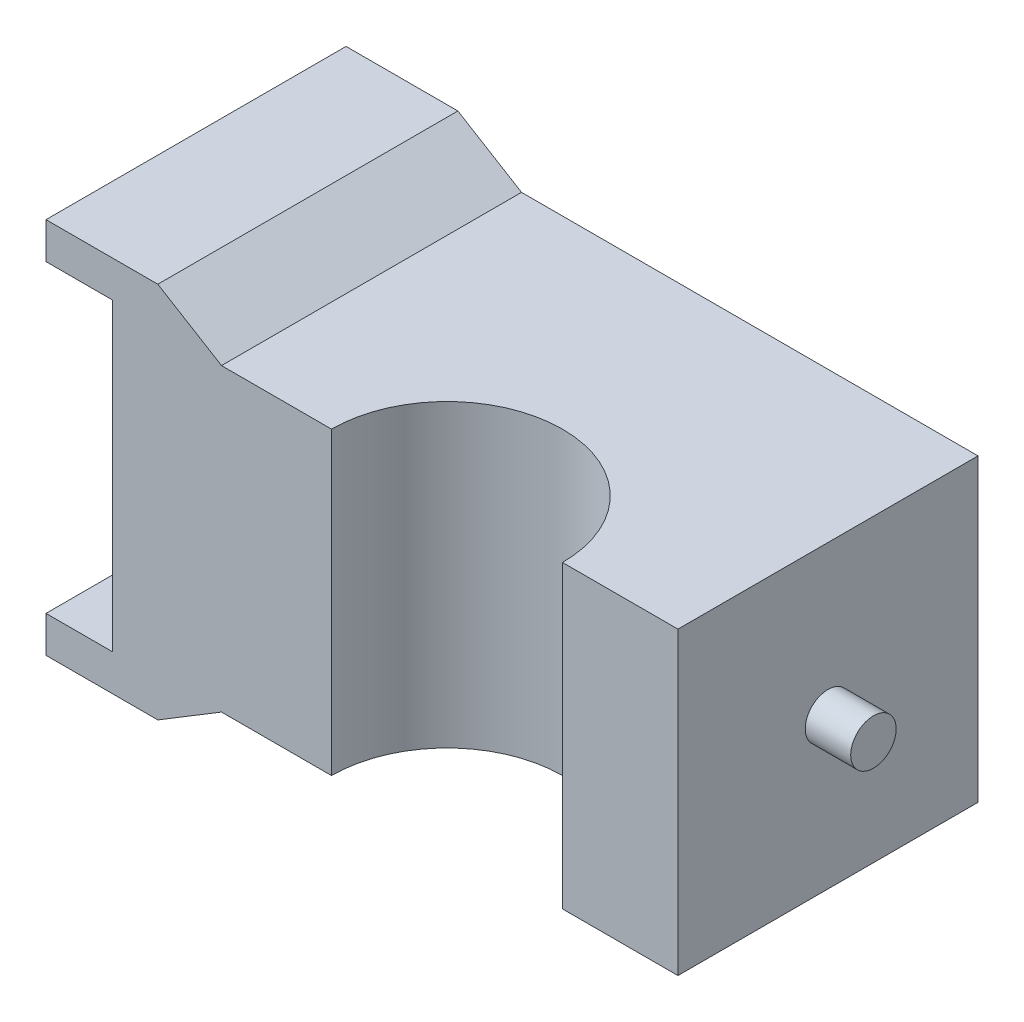
ISO-10303-21;
HEADER;
FILE_DESCRIPTION(('STEP AP214'),'2;1');
FILE_NAME('part.step','',(''),(''),'','','');
FILE_SCHEMA(('AUTOMOTIVE_DESIGN { 1 0 10303 214 1 1 1 1 }'));
ENDSEC;
DATA;
#1=APPLICATION_CONTEXT('core data for automotive mechanical design processes');
#2=APPLICATION_PROTOCOL_DEFINITION('international standard','automotive_design',2000,#1);
#3=PRODUCT_CONTEXT('',#1,'mechanical');
#4=PRODUCT('Part','Part','',(#3));
#5=PRODUCT_RELATED_PRODUCT_CATEGORY('part','',(#4));
#6=PRODUCT_DEFINITION_FORMATION('','',#4);
#7=PRODUCT_DEFINITION_CONTEXT('part definition',#1,'design');
#8=PRODUCT_DEFINITION('design','',#6,#7);
#9=PRODUCT_DEFINITION_SHAPE('','',#8);
#10=(LENGTH_UNIT() NAMED_UNIT(*) SI_UNIT(.MILLI.,.METRE.));
#11=(NAMED_UNIT(*) PLANE_ANGLE_UNIT() SI_UNIT($,.RADIAN.));
#12=(NAMED_UNIT(*) SI_UNIT($,.STERADIAN.) SOLID_ANGLE_UNIT());
#13=UNCERTAINTY_MEASURE_WITH_UNIT(LENGTH_MEASURE(1.E-05),#10,'distance_accuracy_value','');
#14=(GEOMETRIC_REPRESENTATION_CONTEXT(3) GLOBAL_UNCERTAINTY_ASSIGNED_CONTEXT((#13)) GLOBAL_UNIT_ASSIGNED_CONTEXT((#10,
#11,#12)) REPRESENTATION_CONTEXT('',''));
#15=CARTESIAN_POINT('',(0.,0.,0.));
#16=DIRECTION('',(0.,0.,1.));
#17=DIRECTION('',(1.,0.,0.));
#18=AXIS2_PLACEMENT_3D('',#15,#16,#17);
#19=CARTESIAN_POINT('',(0.,0.,16.5));
#20=DIRECTION('',(0.,0.,-1.));
#21=DIRECTION('',(-1.,0.,0.));
#22=AXIS2_PLACEMENT_3D('',#19,#20,#21);
#23=PLANE('',#22);
#24=DIRECTION('',(0.,-1.,0.));
#25=VECTOR('',#24,1.);
#26=CARTESIAN_POINT('',(12.4,20.75,16.5));
#27=LINE('',#26,#25);
#28=CARTESIAN_POINT('',(12.4,-16.5,16.5));
#29=VERTEX_POINT('',#28);
#30=CARTESIAN_POINT('',(12.4,16.5,16.5));
#31=VERTEX_POINT('',#30);
#32=EDGE_CURVE('E11',#29,#31,#27,.F.);
#33=ORIENTED_EDGE('',*,*,#32,.F.);
#34=DIRECTION('',(1.,0.,0.));
#35=VECTOR('',#34,1.);
#36=CARTESIAN_POINT('',(25.1,-16.5,16.5));
#37=LINE('',#36,#35);
#38=CARTESIAN_POINT('',(25.1,-16.5,16.5));
#39=VERTEX_POINT('',#38);
#40=EDGE_CURVE('E63',#29,#39,#37,.T.);
#41=ORIENTED_EDGE('',*,*,#40,.T.);
#42=DIRECTION('',(0.,1.,0.));
#43=VECTOR('',#42,1.);
#44=CARTESIAN_POINT('',(25.1,16.5,16.5));
#45=LINE('',#44,#43);
#46=CARTESIAN_POINT('',(25.1,16.5,16.5));
#47=VERTEX_POINT('',#46);
#48=EDGE_CURVE('E201',#39,#47,#45,.T.);
#49=ORIENTED_EDGE('',*,*,#48,.T.);
#50=DIRECTION('',(-1.,0.,0.));
#51=VECTOR('',#50,1.);
#52=CARTESIAN_POINT('',(25.1,16.5,16.5));
#53=LINE('',#52,#51);
#54=EDGE_CURVE('E117',#47,#31,#53,.T.);
#55=ORIENTED_EDGE('',*,*,#54,.T.);
#56=EDGE_LOOP('',(#33,#41,#49,#55));
#57=FACE_BOUND('',#56,.T.);
#58=ADVANCED_FACE('F40',(#57),#23,.F.);
#59=DIRECTION('',(0.,-1.,0.));
#60=VECTOR('',#59,1.);
#61=CARTESIAN_POINT('',(-13.,20.75,16.5));
#62=LINE('',#61,#60);
#63=CARTESIAN_POINT('',(-13.,16.5000000000001,16.5));
#64=VERTEX_POINT('',#63);
#65=CARTESIAN_POINT('',(-13.,-16.5,16.5));
#66=VERTEX_POINT('',#65);
#67=EDGE_CURVE('E48',#64,#66,#62,.T.);
#68=ORIENTED_EDGE('',*,*,#67,.F.);
#69=CARTESIAN_POINT('',(-25.1,16.5,16.5));
#70=VERTEX_POINT('',#69);
#71=EDGE_CURVE('E251',#64,#70,#53,.T.);
#72=ORIENTED_EDGE('',*,*,#71,.T.);
#73=DIRECTION('',(-0.854787515221729,0.518978134241763,0.));
#74=VECTOR('',#73,1.);
#75=CARTESIAN_POINT('',(-32.1,20.75,16.5));
#76=LINE('',#75,#74);
#77=CARTESIAN_POINT('',(-32.1,20.75,16.5));
#78=VERTEX_POINT('',#77);
#79=EDGE_CURVE('E253',#70,#78,#76,.T.);
#80=ORIENTED_EDGE('',*,*,#79,.T.);
#81=DIRECTION('',(-1.,0.,0.));
#82=VECTOR('',#81,1.);
#83=CARTESIAN_POINT('',(-44.4,20.75,16.5));
#84=LINE('',#83,#82);
#85=CARTESIAN_POINT('',(-44.4,20.75,16.5));
#86=VERTEX_POINT('',#85);
#87=EDGE_CURVE('E255',#78,#86,#84,.T.);
#88=ORIENTED_EDGE('',*,*,#87,.T.);
#89=DIRECTION('',(0.,-1.,0.));
#90=VECTOR('',#89,1.);
#91=CARTESIAN_POINT('',(-44.4,20.75,16.5));
#92=LINE('',#91,#90);
#93=CARTESIAN_POINT('',(-44.4,16.75,16.5));
#94=VERTEX_POINT('',#93);
#95=EDGE_CURVE('E257',#86,#94,#92,.T.);
#96=ORIENTED_EDGE('',*,*,#95,.T.);
#97=DIRECTION('',(1.,0.,0.));
#98=VECTOR('',#97,1.);
#99=CARTESIAN_POINT('',(-44.4,16.75,16.5));
#100=LINE('',#99,#98);
#101=CARTESIAN_POINT('',(-37.1,16.75,16.5));
#102=VERTEX_POINT('',#101);
#103=EDGE_CURVE('E259',#94,#102,#100,.T.);
#104=ORIENTED_EDGE('',*,*,#103,.T.);
#105=DIRECTION('',(0.,-1.,0.));
#106=VECTOR('',#105,1.);
#107=CARTESIAN_POINT('',(-37.1,16.75,16.5));
#108=LINE('',#107,#106);
#109=CARTESIAN_POINT('',(-37.1,-16.75,16.5));
#110=VERTEX_POINT('',#109);
#111=EDGE_CURVE('E261',#102,#110,#108,.T.);
#112=ORIENTED_EDGE('',*,*,#111,.T.);
#113=DIRECTION('',(-1.,0.,0.));
#114=VECTOR('',#113,1.);
#115=CARTESIAN_POINT('',(-44.4,-16.75,16.5));
#116=LINE('',#115,#114);
#117=CARTESIAN_POINT('',(-44.4,-16.75,16.5));
#118=VERTEX_POINT('',#117);
#119=EDGE_CURVE('E263',#110,#118,#116,.T.);
#120=ORIENTED_EDGE('',*,*,#119,.T.);
#121=DIRECTION('',(0.,-1.,0.));
#122=VECTOR('',#121,1.);
#123=CARTESIAN_POINT('',(-44.4,-20.75,16.5));
#124=LINE('',#123,#122);
#125=CARTESIAN_POINT('',(-44.4,-20.75,16.5));
#126=VERTEX_POINT('',#125);
#127=EDGE_CURVE('E154',#118,#126,#124,.T.);
#128=ORIENTED_EDGE('',*,*,#127,.T.);
#129=DIRECTION('',(1.,0.,0.));
#130=VECTOR('',#129,1.);
#131=CARTESIAN_POINT('',(-44.4,-20.75,16.5));
#132=LINE('',#131,#130);
#133=CARTESIAN_POINT('',(-32.1,-20.75,16.5));
#134=VERTEX_POINT('',#133);
#135=EDGE_CURVE('E146',#126,#134,#132,.T.);
#136=ORIENTED_EDGE('',*,*,#135,.T.);
#137=DIRECTION('',(0.85478751522173,0.518978134241763,0.));
#138=VECTOR('',#137,1.);
#139=CARTESIAN_POINT('',(-32.1,-20.75,16.5));
#140=LINE('',#139,#138);
#141=CARTESIAN_POINT('',(-25.1,-16.5,16.5));
#142=VERTEX_POINT('',#141);
#143=EDGE_CURVE('E151',#134,#142,#140,.T.);
#144=ORIENTED_EDGE('',*,*,#143,.T.);
#145=EDGE_CURVE('E172',#142,#66,#37,.T.);
#146=ORIENTED_EDGE('',*,*,#145,.T.);
#147=EDGE_LOOP('',(#68,#72,#80,#88,#96,#104,#112,#120,#128,#136,#144,#146));
#148=FACE_BOUND('',#147,.T.);
#149=ADVANCED_FACE('F148',(#148),#23,.F.);
#150=CARTESIAN_POINT('',(25.1,16.5,16.5));
#151=DIRECTION('',(-1.,0.,0.));
#152=DIRECTION('',(0.,-1.,0.));
#153=AXIS2_PLACEMENT_3D('',#150,#151,#152);
#154=PLANE('',#153);
#155=DIRECTION('',(0.,1.,0.));
#156=VECTOR('',#155,1.);
#157=CARTESIAN_POINT('',(25.1,16.5,-16.5));
#158=LINE('',#157,#156);
#159=CARTESIAN_POINT('',(25.1,-16.5,-16.5));
#160=VERTEX_POINT('',#159);
#161=CARTESIAN_POINT('',(25.1,16.5,-16.5));
#162=VERTEX_POINT('',#161);
#163=EDGE_CURVE('E177',#160,#162,#158,.T.);
#164=ORIENTED_EDGE('',*,*,#163,.T.);
#165=DIRECTION('',(0.,0.,-1.));
#166=VECTOR('',#165,1.);
#167=CARTESIAN_POINT('',(25.1,16.5,16.5));
#168=LINE('',#167,#166);
#169=EDGE_CURVE('E226',#47,#162,#168,.T.);
#170=ORIENTED_EDGE('',*,*,#169,.F.);
#171=ORIENTED_EDGE('',*,*,#48,.F.);
#172=DIRECTION('',(0.,0.,-1.));
#173=VECTOR('',#172,1.);
#174=CARTESIAN_POINT('',(25.1,-16.5,16.5));
#175=LINE('',#174,#173);
#176=EDGE_CURVE('E176',#39,#160,#175,.T.);
#177=ORIENTED_EDGE('',*,*,#176,.T.);
#178=EDGE_LOOP('',(#164,#170,#171,#177));
#179=FACE_BOUND('',#178,.T.);
#180=CARTESIAN_POINT('',(25.1,0.,0.));
#181=DIRECTION('',(-1.,0.,0.));
#182=DIRECTION('',(0.,-1.,0.));
#183=AXIS2_PLACEMENT_3D('',#180,#181,#182);
#184=CIRCLE('',#183,2.5);
#185=CARTESIAN_POINT('',(25.1,-2.50000000000001,0.));
#186=VERTEX_POINT('',#185);
#187=EDGE_CURVE('E231',#186,#186,#184,.F.);
#188=ORIENTED_EDGE('',*,*,#187,.F.);
#189=EDGE_LOOP('',(#188));
#190=FACE_BOUND('',#189,.T.);
#191=ADVANCED_FACE('F42',(#179,#190),#154,.F.);
#192=CARTESIAN_POINT('',(-37.1,16.75,16.5));
#193=DIRECTION('',(1.,0.,0.));
#194=DIRECTION('',(0.,1.,0.));
#195=AXIS2_PLACEMENT_3D('',#192,#193,#194);
#196=PLANE('',#195);
#197=DIRECTION('',(0.,-1.,0.));
#198=VECTOR('',#197,1.);
#199=CARTESIAN_POINT('',(-37.1,16.75,-16.5));
#200=LINE('',#199,#198);
#201=CARTESIAN_POINT('',(-37.1,16.75,-16.5));
#202=VERTEX_POINT('',#201);
#203=CARTESIAN_POINT('',(-37.1,-16.75,-16.5));
#204=VERTEX_POINT('',#203);
#205=EDGE_CURVE('E191',#202,#204,#200,.T.);
#206=ORIENTED_EDGE('',*,*,#205,.T.);
#207=DIRECTION('',(0.,0.,-1.));
#208=VECTOR('',#207,1.);
#209=CARTESIAN_POINT('',(-37.1,-16.75,16.5));
#210=LINE('',#209,#208);
#211=EDGE_CURVE('E208',#110,#204,#210,.T.);
#212=ORIENTED_EDGE('',*,*,#211,.F.);
#213=ORIENTED_EDGE('',*,*,#111,.F.);
#214=DIRECTION('',(0.,0.,-1.));
#215=VECTOR('',#214,1.);
#216=CARTESIAN_POINT('',(-37.1,16.75,16.5));
#217=LINE('',#216,#215);
#218=EDGE_CURVE('E211',#102,#202,#217,.T.);
#219=ORIENTED_EDGE('',*,*,#218,.T.);
#220=EDGE_LOOP('',(#206,#212,#213,#219));
#221=FACE_BOUND('',#220,.T.);
#222=CARTESIAN_POINT('',(-37.1,0.,0.));
#223=DIRECTION('',(1.,0.,0.));
#224=DIRECTION('',(0.,1.,0.));
#225=AXIS2_PLACEMENT_3D('',#222,#223,#224);
#226=CIRCLE('',#225,2.5);
#227=CARTESIAN_POINT('',(-37.1,2.49999999999999,0.));
#228=VERTEX_POINT('',#227);
#229=EDGE_CURVE('E228',#228,#228,#226,.F.);
#230=ORIENTED_EDGE('',*,*,#229,.F.);
#231=EDGE_LOOP('',(#230));
#232=FACE_BOUND('',#231,.T.);
#233=ADVANCED_FACE('F305',(#221,#232),#196,.F.);
#234=CARTESIAN_POINT('',(25.1,16.5,16.5));
#235=DIRECTION('',(0.,-1.,0.));
#236=DIRECTION('',(1.,0.,0.));
#237=AXIS2_PLACEMENT_3D('',#234,#235,#236);
#238=PLANE('',#237);
#239=CARTESIAN_POINT('',(-0.299999999999998,16.5,16.5));
#240=DIRECTION('',(0.,-1.,0.));
#241=DIRECTION('',(1.,0.,0.));
#242=AXIS2_PLACEMENT_3D('',#239,#240,#241);
#243=CIRCLE('',#242,12.7);
#244=EDGE_CURVE('E54',#31,#64,#243,.F.);
#245=ORIENTED_EDGE('',*,*,#244,.F.);
#246=ORIENTED_EDGE('',*,*,#54,.F.);
#247=ORIENTED_EDGE('',*,*,#169,.T.);
#248=DIRECTION('',(-1.,0.,0.));
#249=VECTOR('',#248,1.);
#250=CARTESIAN_POINT('',(25.1,16.5,-16.5));
#251=LINE('',#250,#249);
#252=CARTESIAN_POINT('',(-25.1,16.5,-16.5));
#253=VERTEX_POINT('',#252);
#254=EDGE_CURVE('E180',#162,#253,#251,.T.);
#255=ORIENTED_EDGE('',*,*,#254,.T.);
#256=DIRECTION('',(0.,0.,-1.));
#257=VECTOR('',#256,1.);
#258=CARTESIAN_POINT('',(-25.1,16.5,16.5));
#259=LINE('',#258,#257);
#260=EDGE_CURVE('E223',#70,#253,#259,.T.);
#261=ORIENTED_EDGE('',*,*,#260,.F.);
#262=ORIENTED_EDGE('',*,*,#71,.F.);
#263=EDGE_LOOP('',(#245,#246,#247,#255,#261,#262));
#264=FACE_BOUND('',#263,.T.);
#265=ADVANCED_FACE('F282',(#264),#238,.F.);
#266=CARTESIAN_POINT('',(-32.1,20.75,16.5));
#267=DIRECTION('',(-0.518978134241763,-0.854787515221729,0.));
#268=DIRECTION('',(0.85478751522173,-0.518978134241763,0.));
#269=AXIS2_PLACEMENT_3D('',#266,#267,#268);
#270=PLANE('',#269);
#271=DIRECTION('',(-0.854787515221729,0.518978134241763,0.));
#272=VECTOR('',#271,1.);
#273=CARTESIAN_POINT('',(-32.1,20.75,-16.5));
#274=LINE('',#273,#272);
#275=CARTESIAN_POINT('',(-32.1,20.75,-16.5));
#276=VERTEX_POINT('',#275);
#277=EDGE_CURVE('E183',#253,#276,#274,.T.);
#278=ORIENTED_EDGE('',*,*,#277,.T.);
#279=DIRECTION('',(0.,0.,-1.));
#280=VECTOR('',#279,1.);
#281=CARTESIAN_POINT('',(-32.1,20.75,16.5));
#282=LINE('',#281,#280);
#283=EDGE_CURVE('E220',#78,#276,#282,.T.);
#284=ORIENTED_EDGE('',*,*,#283,.F.);
#285=ORIENTED_EDGE('',*,*,#79,.F.);
#286=ORIENTED_EDGE('',*,*,#260,.T.);
#287=EDGE_LOOP('',(#278,#284,#285,#286));
#288=FACE_BOUND('',#287,.T.);
#289=ADVANCED_FACE('F289',(#288),#270,.F.);
#290=CARTESIAN_POINT('',(-44.4,20.75,16.5));
#291=DIRECTION('',(0.,-1.,0.));
#292=DIRECTION('',(1.,0.,0.));
#293=AXIS2_PLACEMENT_3D('',#290,#291,#292);
#294=PLANE('',#293);
#295=DIRECTION('',(-1.,0.,0.));
#296=VECTOR('',#295,1.);
#297=CARTESIAN_POINT('',(-44.4,20.75,-16.5));
#298=LINE('',#297,#296);
#299=CARTESIAN_POINT('',(-44.4,20.75,-16.5));
#300=VERTEX_POINT('',#299);
#301=EDGE_CURVE('E185',#276,#300,#298,.T.);
#302=ORIENTED_EDGE('',*,*,#301,.T.);
#303=DIRECTION('',(0.,0.,-1.));
#304=VECTOR('',#303,1.);
#305=CARTESIAN_POINT('',(-44.4,20.75,16.5));
#306=LINE('',#305,#304);
#307=EDGE_CURVE('E217',#86,#300,#306,.T.);
#308=ORIENTED_EDGE('',*,*,#307,.F.);
#309=ORIENTED_EDGE('',*,*,#87,.F.);
#310=ORIENTED_EDGE('',*,*,#283,.T.);
#311=EDGE_LOOP('',(#302,#308,#309,#310));
#312=FACE_BOUND('',#311,.T.);
#313=ADVANCED_FACE('F292',(#312),#294,.F.);
#314=CARTESIAN_POINT('',(-44.4,20.75,16.5));
#315=DIRECTION('',(1.,0.,0.));
#316=DIRECTION('',(0.,1.,0.));
#317=AXIS2_PLACEMENT_3D('',#314,#315,#316);
#318=PLANE('',#317);
#319=DIRECTION('',(0.,-1.,0.));
#320=VECTOR('',#319,1.);
#321=CARTESIAN_POINT('',(-44.4,20.75,-16.5));
#322=LINE('',#321,#320);
#323=CARTESIAN_POINT('',(-44.4,16.75,-16.5));
#324=VERTEX_POINT('',#323);
#325=EDGE_CURVE('E187',#300,#324,#322,.T.);
#326=ORIENTED_EDGE('',*,*,#325,.T.);
#327=DIRECTION('',(0.,0.,-1.));
#328=VECTOR('',#327,1.);
#329=CARTESIAN_POINT('',(-44.4,16.75,16.5));
#330=LINE('',#329,#328);
#331=EDGE_CURVE('E214',#94,#324,#330,.T.);
#332=ORIENTED_EDGE('',*,*,#331,.F.);
#333=ORIENTED_EDGE('',*,*,#95,.F.);
#334=ORIENTED_EDGE('',*,*,#307,.T.);
#335=EDGE_LOOP('',(#326,#332,#333,#334));
#336=FACE_BOUND('',#335,.T.);
#337=ADVANCED_FACE('F297',(#336),#318,.F.);
#338=CARTESIAN_POINT('',(-44.4,16.75,16.5));
#339=DIRECTION('',(0.,1.,0.));
#340=DIRECTION('',(-1.,0.,0.));
#341=AXIS2_PLACEMENT_3D('',#338,#339,#340);
#342=PLANE('',#341);
#343=DIRECTION('',(1.,0.,0.));
#344=VECTOR('',#343,1.);
#345=CARTESIAN_POINT('',(-44.4,16.75,-16.5));
#346=LINE('',#345,#344);
#347=EDGE_CURVE('E189',#324,#202,#346,.T.);
#348=ORIENTED_EDGE('',*,*,#347,.T.);
#349=ORIENTED_EDGE('',*,*,#218,.F.);
#350=ORIENTED_EDGE('',*,*,#103,.F.);
#351=ORIENTED_EDGE('',*,*,#331,.T.);
#352=EDGE_LOOP('',(#348,#349,#350,#351));
#353=FACE_BOUND('',#352,.T.);
#354=ADVANCED_FACE('F301',(#353),#342,.F.);
#355=CARTESIAN_POINT('',(-44.4,-16.75,16.5));
#356=DIRECTION('',(0.,-1.,0.));
#357=DIRECTION('',(1.,0.,0.));
#358=AXIS2_PLACEMENT_3D('',#355,#356,#357);
#359=PLANE('',#358);
#360=DIRECTION('',(-1.,0.,0.));
#361=VECTOR('',#360,1.);
#362=CARTESIAN_POINT('',(-44.4,-16.75,-16.5));
#363=LINE('',#362,#361);
#364=CARTESIAN_POINT('',(-44.4,-16.75,-16.5));
#365=VERTEX_POINT('',#364);
#366=EDGE_CURVE('E193',#204,#365,#363,.T.);
#367=ORIENTED_EDGE('',*,*,#366,.T.);
#368=DIRECTION('',(0.,0.,-1.));
#369=VECTOR('',#368,1.);
#370=CARTESIAN_POINT('',(-44.4,-16.75,16.5));
#371=LINE('',#370,#369);
#372=EDGE_CURVE('E205',#118,#365,#371,.T.);
#373=ORIENTED_EDGE('',*,*,#372,.F.);
#374=ORIENTED_EDGE('',*,*,#119,.F.);
#375=ORIENTED_EDGE('',*,*,#211,.T.);
#376=EDGE_LOOP('',(#367,#373,#374,#375));
#377=FACE_BOUND('',#376,.T.);
#378=ADVANCED_FACE('F269',(#377),#359,.F.);
#379=CARTESIAN_POINT('',(-44.4,-20.75,16.5));
#380=DIRECTION('',(1.,0.,0.));
#381=DIRECTION('',(0.,1.,0.));
#382=AXIS2_PLACEMENT_3D('',#379,#380,#381);
#383=PLANE('',#382);
#384=DIRECTION('',(0.,-1.,0.));
#385=VECTOR('',#384,1.);
#386=CARTESIAN_POINT('',(-44.4,-20.75,-16.5));
#387=LINE('',#386,#385);
#388=CARTESIAN_POINT('',(-44.4,-20.75,-16.5));
#389=VERTEX_POINT('',#388);
#390=EDGE_CURVE('E195',#365,#389,#387,.T.);
#391=ORIENTED_EDGE('',*,*,#390,.T.);
#392=DIRECTION('',(0.,0.,-1.));
#393=VECTOR('',#392,1.);
#394=CARTESIAN_POINT('',(-44.4,-20.75,16.5));
#395=LINE('',#394,#393);
#396=EDGE_CURVE('E166',#126,#389,#395,.T.);
#397=ORIENTED_EDGE('',*,*,#396,.F.);
#398=ORIENTED_EDGE('',*,*,#127,.F.);
#399=ORIENTED_EDGE('',*,*,#372,.T.);
#400=EDGE_LOOP('',(#391,#397,#398,#399));
#401=FACE_BOUND('',#400,.T.);
#402=ADVANCED_FACE('F273',(#401),#383,.F.);
#403=CARTESIAN_POINT('',(-44.4,-20.75,16.5));
#404=DIRECTION('',(0.,1.,0.));
#405=DIRECTION('',(-1.,0.,0.));
#406=AXIS2_PLACEMENT_3D('',#403,#404,#405);
#407=PLANE('',#406);
#408=DIRECTION('',(1.,0.,0.));
#409=VECTOR('',#408,1.);
#410=CARTESIAN_POINT('',(-44.4,-20.75,-16.5));
#411=LINE('',#410,#409);
#412=CARTESIAN_POINT('',(-32.1,-20.75,-16.5));
#413=VERTEX_POINT('',#412);
#414=EDGE_CURVE('E163',#389,#413,#411,.T.);
#415=ORIENTED_EDGE('',*,*,#414,.T.);
#416=DIRECTION('',(0.,0.,-1.));
#417=VECTOR('',#416,1.);
#418=CARTESIAN_POINT('',(-32.1,-20.75,16.5));
#419=LINE('',#418,#417);
#420=EDGE_CURVE('E160',#134,#413,#419,.T.);
#421=ORIENTED_EDGE('',*,*,#420,.F.);
#422=ORIENTED_EDGE('',*,*,#135,.F.);
#423=ORIENTED_EDGE('',*,*,#396,.T.);
#424=EDGE_LOOP('',(#415,#421,#422,#423));
#425=FACE_BOUND('',#424,.T.);
#426=ADVANCED_FACE('F161',(#425),#407,.F.);
#427=CARTESIAN_POINT('',(-32.1,-20.75,16.5));
#428=DIRECTION('',(-0.518978134241763,0.854787515221729,0.));
#429=DIRECTION('',(-0.85478751522173,-0.518978134241763,0.));
#430=AXIS2_PLACEMENT_3D('',#427,#428,#429);
#431=PLANE('',#430);
#432=DIRECTION('',(0.85478751522173,0.518978134241763,0.));
#433=VECTOR('',#432,1.);
#434=CARTESIAN_POINT('',(-32.1,-20.75,-16.5));
#435=LINE('',#434,#433);
#436=CARTESIAN_POINT('',(-25.1,-16.5,-16.5));
#437=VERTEX_POINT('',#436);
#438=EDGE_CURVE('E198',#413,#437,#435,.T.);
#439=ORIENTED_EDGE('',*,*,#438,.T.);
#440=DIRECTION('',(0.,0.,-1.));
#441=VECTOR('',#440,1.);
#442=CARTESIAN_POINT('',(-25.1,-16.5,16.5));
#443=LINE('',#442,#441);
#444=EDGE_CURVE('E167',#142,#437,#443,.T.);
#445=ORIENTED_EDGE('',*,*,#444,.F.);
#446=ORIENTED_EDGE('',*,*,#143,.F.);
#447=ORIENTED_EDGE('',*,*,#420,.T.);
#448=EDGE_LOOP('',(#439,#445,#446,#447));
#449=FACE_BOUND('',#448,.T.);
#450=ADVANCED_FACE('F169',(#449),#431,.F.);
#451=CARTESIAN_POINT('',(25.1,-16.5,16.5));
#452=DIRECTION('',(0.,1.,0.));
#453=DIRECTION('',(0.,0.,1.));
#454=AXIS2_PLACEMENT_3D('',#451,#452,#453);
#455=PLANE('',#454);
#456=CARTESIAN_POINT('',(-0.299999999999998,-16.5,16.5));
#457=DIRECTION('',(0.,1.,0.));
#458=DIRECTION('',(0.,0.,1.));
#459=AXIS2_PLACEMENT_3D('',#456,#457,#458);
#460=CIRCLE('',#459,12.7);
#461=EDGE_CURVE('E238',#66,#29,#460,.F.);
#462=ORIENTED_EDGE('',*,*,#461,.F.);
#463=ORIENTED_EDGE('',*,*,#145,.F.);
#464=ORIENTED_EDGE('',*,*,#444,.T.);
#465=DIRECTION('',(1.,0.,0.));
#466=VECTOR('',#465,1.);
#467=CARTESIAN_POINT('',(25.1,-16.5,-16.5));
#468=LINE('',#467,#466);
#469=EDGE_CURVE('E109',#437,#160,#468,.T.);
#470=ORIENTED_EDGE('',*,*,#469,.T.);
#471=ORIENTED_EDGE('',*,*,#176,.F.);
#472=ORIENTED_EDGE('',*,*,#40,.F.);
#473=EDGE_LOOP('',(#462,#463,#464,#470,#471,#472));
#474=FACE_BOUND('',#473,.T.);
#475=ADVANCED_FACE('F241',(#474),#455,.F.);
#476=CARTESIAN_POINT('',(0.,0.,-16.5));
#477=DIRECTION('',(0.,0.,-1.));
#478=DIRECTION('',(-1.,0.,0.));
#479=AXIS2_PLACEMENT_3D('',#476,#477,#478);
#480=PLANE('',#479);
#481=ORIENTED_EDGE('',*,*,#163,.F.);
#482=ORIENTED_EDGE('',*,*,#469,.F.);
#483=ORIENTED_EDGE('',*,*,#438,.F.);
#484=ORIENTED_EDGE('',*,*,#414,.F.);
#485=ORIENTED_EDGE('',*,*,#390,.F.);
#486=ORIENTED_EDGE('',*,*,#366,.F.);
#487=ORIENTED_EDGE('',*,*,#205,.F.);
#488=ORIENTED_EDGE('',*,*,#347,.F.);
#489=ORIENTED_EDGE('',*,*,#325,.F.);
#490=ORIENTED_EDGE('',*,*,#301,.F.);
#491=ORIENTED_EDGE('',*,*,#277,.F.);
#492=ORIENTED_EDGE('',*,*,#254,.F.);
#493=EDGE_LOOP('',(#481,#482,#483,#484,#485,#486,#487,#488,#489,#490,#491,#492));
#494=FACE_BOUND('',#493,.T.);
#495=ADVANCED_FACE('F276',(#494),#480,.T.);
#496=CARTESIAN_POINT('',(-42.1,0.,0.));
#497=DIRECTION('',(1.,0.,0.));
#498=DIRECTION('',(0.,0.,-1.));
#499=AXIS2_PLACEMENT_3D('',#496,#497,#498);
#500=CYLINDRICAL_SURFACE('',#499,2.5);
#501=CARTESIAN_POINT('',(-42.1,0.,0.));
#502=DIRECTION('',(-1.,0.,0.));
#503=DIRECTION('',(0.,0.,1.));
#504=AXIS2_PLACEMENT_3D('',#501,#502,#503);
#505=CIRCLE('',#504,2.5);
#506=CARTESIAN_POINT('',(-42.1,0.,2.5));
#507=VERTEX_POINT('',#506);
#508=EDGE_CURVE('E181',#507,#507,#505,.T.);
#509=ORIENTED_EDGE('',*,*,#508,.F.);
#510=EDGE_LOOP('',(#509));
#511=FACE_BOUND('',#510,.T.);
#512=ORIENTED_EDGE('',*,*,#229,.T.);
#513=EDGE_LOOP('',(#512));
#514=FACE_BOUND('',#513,.T.);
#515=ADVANCED_FACE('F311',(#511,#514),#500,.T.);
#516=CARTESIAN_POINT('',(-42.1,0.,0.));
#517=DIRECTION('',(-1.,0.,0.));
#518=DIRECTION('',(0.,0.,1.));
#519=AXIS2_PLACEMENT_3D('',#516,#517,#518);
#520=PLANE('',#519);
#521=ORIENTED_EDGE('',*,*,#508,.T.);
#522=EDGE_LOOP('',(#521));
#523=FACE_BOUND('',#522,.T.);
#524=ADVANCED_FACE('F313',(#523),#520,.T.);
#525=CARTESIAN_POINT('',(30.1,0.,0.));
#526=DIRECTION('',(-1.,0.,0.));
#527=DIRECTION('',(0.,-1.,0.));
#528=AXIS2_PLACEMENT_3D('',#525,#526,#527);
#529=CYLINDRICAL_SURFACE('',#528,2.5);
#530=CARTESIAN_POINT('',(30.1,0.,0.));
#531=DIRECTION('',(1.,0.,0.));
#532=DIRECTION('',(0.,1.,0.));
#533=AXIS2_PLACEMENT_3D('',#530,#531,#532);
#534=CIRCLE('',#533,2.5);
#535=CARTESIAN_POINT('',(30.1,2.49999999999999,0.));
#536=VERTEX_POINT('',#535);
#537=EDGE_CURVE('E243',#536,#536,#534,.T.);
#538=ORIENTED_EDGE('',*,*,#537,.F.);
#539=EDGE_LOOP('',(#538));
#540=FACE_BOUND('',#539,.T.);
#541=ORIENTED_EDGE('',*,*,#187,.T.);
#542=EDGE_LOOP('',(#541));
#543=FACE_BOUND('',#542,.T.);
#544=ADVANCED_FACE('F320',(#540,#543),#529,.T.);
#545=CARTESIAN_POINT('',(30.1,0.,0.));
#546=DIRECTION('',(1.,0.,0.));
#547=DIRECTION('',(0.,1.,0.));
#548=AXIS2_PLACEMENT_3D('',#545,#546,#547);
#549=PLANE('',#548);
#550=ORIENTED_EDGE('',*,*,#537,.T.);
#551=EDGE_LOOP('',(#550));
#552=FACE_BOUND('',#551,.T.);
#553=ADVANCED_FACE('F413',(#552),#549,.T.);
#554=CARTESIAN_POINT('',(-0.299999999999998,20.75,16.5));
#555=DIRECTION('',(0.,-1.,0.));
#556=DIRECTION('',(0.,0.,-1.));
#557=AXIS2_PLACEMENT_3D('',#554,#555,#556);
#558=CYLINDRICAL_SURFACE('',#557,12.7);
#559=ORIENTED_EDGE('',*,*,#32,.T.);
#560=ORIENTED_EDGE('',*,*,#244,.T.);
#561=ORIENTED_EDGE('',*,*,#67,.T.);
#562=ORIENTED_EDGE('',*,*,#461,.T.);
#563=EDGE_LOOP('',(#559,#560,#561,#562));
#564=FACE_BOUND('',#563,.T.);
#565=ADVANCED_FACE('F236',(#564),#558,.F.);
#566=CLOSED_SHELL('',(#58,#149,#191,#233,#265,#289,#313,#337,#354,#378,#402,#426,#450,#475,#495,
#515,#524,#544,#553,#565));
#567=MANIFOLD_SOLID_BREP('B2',#566);
#568=ADVANCED_BREP_SHAPE_REPRESENTATION('',(#18,#567),#14);
#569=SHAPE_DEFINITION_REPRESENTATION(#9,#568);
ENDSEC;
END-ISO-10303-21;
